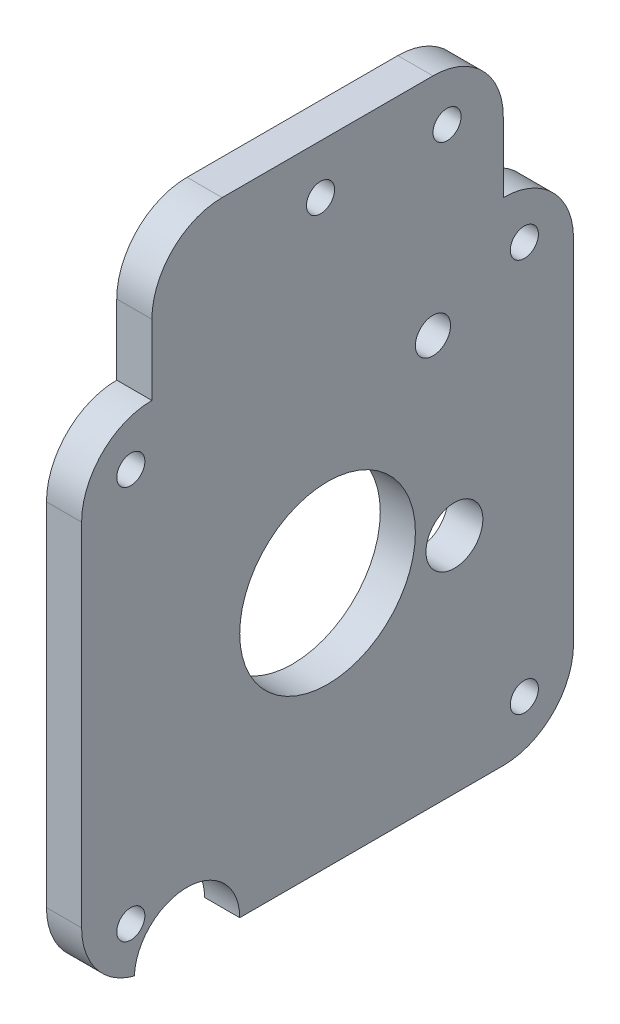
ISO-10303-21;
HEADER;
FILE_DESCRIPTION(('STEP AP214'),'2;1');
FILE_NAME('part.step','',(''),(''),'','','');
FILE_SCHEMA(('AUTOMOTIVE_DESIGN { 1 0 10303 214 1 1 1 1 }'));
ENDSEC;
DATA;
#1=APPLICATION_CONTEXT('core data for automotive mechanical design processes');
#2=APPLICATION_PROTOCOL_DEFINITION('international standard','automotive_design',2000,#1);
#3=PRODUCT_CONTEXT('',#1,'mechanical');
#4=PRODUCT('Part','Part','',(#3));
#5=PRODUCT_RELATED_PRODUCT_CATEGORY('part','',(#4));
#6=PRODUCT_DEFINITION_FORMATION('','',#4);
#7=PRODUCT_DEFINITION_CONTEXT('part definition',#1,'design');
#8=PRODUCT_DEFINITION('design','',#6,#7);
#9=PRODUCT_DEFINITION_SHAPE('','',#8);
#10=(LENGTH_UNIT() NAMED_UNIT(*) SI_UNIT(.MILLI.,.METRE.));
#11=(NAMED_UNIT(*) PLANE_ANGLE_UNIT() SI_UNIT($,.RADIAN.));
#12=(NAMED_UNIT(*) SI_UNIT($,.STERADIAN.) SOLID_ANGLE_UNIT());
#13=UNCERTAINTY_MEASURE_WITH_UNIT(LENGTH_MEASURE(1.E-05),#10,'distance_accuracy_value','');
#14=(GEOMETRIC_REPRESENTATION_CONTEXT(3) GLOBAL_UNCERTAINTY_ASSIGNED_CONTEXT((#13)) GLOBAL_UNIT_ASSIGNED_CONTEXT((#10,
#11,#12)) REPRESENTATION_CONTEXT('',''));
#15=CARTESIAN_POINT('',(0.,0.,0.));
#16=DIRECTION('',(0.,0.,1.));
#17=DIRECTION('',(1.,0.,0.));
#18=AXIS2_PLACEMENT_3D('',#15,#16,#17);
#19=CARTESIAN_POINT('',(5.,10.,-10.));
#20=DIRECTION('',(-1.,0.,0.));
#21=DIRECTION('',(0.,0.,1.));
#22=AXIS2_PLACEMENT_3D('',#19,#20,#21);
#23=PLANE('',#22);
#24=CARTESIAN_POINT('',(5.,58.,-50.));
#25=DIRECTION('',(1.,0.,0.));
#26=DIRECTION('',(0.,0.,-1.));
#27=AXIS2_PLACEMENT_3D('',#24,#25,#26);
#28=CIRCLE('',#27,2.5);
#29=CARTESIAN_POINT('',(5.,58.,-52.5));
#30=VERTEX_POINT('',#29);
#31=EDGE_CURVE('E213',#30,#30,#28,.T.);
#32=ORIENTED_EDGE('',*,*,#31,.F.);
#33=EDGE_LOOP('',(#32));
#34=FACE_BOUND('',#33,.T.);
#35=CARTESIAN_POINT('',(5.,83.,-52.));
#36=DIRECTION('',(1.,0.,0.));
#37=DIRECTION('',(0.,0.,-1.));
#38=AXIS2_PLACEMENT_3D('',#35,#36,#37);
#39=CIRCLE('',#38,2.);
#40=CARTESIAN_POINT('',(5.,83.,-54.));
#41=VERTEX_POINT('',#40);
#42=EDGE_CURVE('E538',#41,#41,#39,.T.);
#43=ORIENTED_EDGE('',*,*,#42,.F.);
#44=EDGE_LOOP('',(#43));
#45=FACE_BOUND('',#44,.T.);
#46=CARTESIAN_POINT('',(5.,83.,-34.));
#47=DIRECTION('',(1.,0.,0.));
#48=DIRECTION('',(0.,0.,-1.));
#49=AXIS2_PLACEMENT_3D('',#46,#47,#48);
#50=CIRCLE('',#49,2.);
#51=CARTESIAN_POINT('',(5.,83.,-36.));
#52=VERTEX_POINT('',#51);
#53=EDGE_CURVE('E228',#52,#52,#50,.T.);
#54=ORIENTED_EDGE('',*,*,#53,.F.);
#55=EDGE_LOOP('',(#54));
#56=FACE_BOUND('',#55,.T.);
#57=CARTESIAN_POINT('',(5.,10.,-10.));
#58=DIRECTION('',(1.,0.,0.));
#59=DIRECTION('',(0.,0.,1.));
#60=AXIS2_PLACEMENT_3D('',#57,#58,#59);
#61=CIRCLE('',#60,10.);
#62=CARTESIAN_POINT('',(5.,10.0000000000001,0.));
#63=VERTEX_POINT('',#62);
#64=CARTESIAN_POINT('',(5.,0.315826351423624,-7.50665270284725));
#65=VERTEX_POINT('',#64);
#66=EDGE_CURVE('E186',#63,#65,#61,.T.);
#67=ORIENTED_EDGE('',*,*,#66,.T.);
#68=CARTESIAN_POINT('',(5.,0.,-15.));
#69=DIRECTION('',(1.,0.,0.));
#70=DIRECTION('',(0.,0.,-1.));
#71=AXIS2_PLACEMENT_3D('',#68,#69,#70);
#72=CIRCLE('',#71,7.5);
#73=CARTESIAN_POINT('',(5.,0.,-22.5));
#74=VERTEX_POINT('',#73);
#75=EDGE_CURVE('E218',#74,#65,#72,.T.);
#76=ORIENTED_EDGE('',*,*,#75,.F.);
#77=DIRECTION('',(0.,0.,-1.));
#78=VECTOR('',#77,1.);
#79=CARTESIAN_POINT('',(5.,0.,-10.0000000000001));
#80=LINE('',#79,#78);
#81=CARTESIAN_POINT('',(5.,0.,-60.));
#82=VERTEX_POINT('',#81);
#83=EDGE_CURVE('E109',#74,#82,#80,.T.);
#84=ORIENTED_EDGE('',*,*,#83,.T.);
#85=CARTESIAN_POINT('',(5.,9.99999999999999,-60.));
#86=DIRECTION('',(1.,0.,0.));
#87=DIRECTION('',(0.,0.,-1.));
#88=AXIS2_PLACEMENT_3D('',#85,#86,#87);
#89=CIRCLE('',#88,10.);
#90=CARTESIAN_POINT('',(5.,9.99999999999999,-70.));
#91=VERTEX_POINT('',#90);
#92=EDGE_CURVE('E269',#82,#91,#89,.T.);
#93=ORIENTED_EDGE('',*,*,#92,.T.);
#94=DIRECTION('',(0.,1.,0.));
#95=VECTOR('',#94,1.);
#96=CARTESIAN_POINT('',(5.,10.,-70.));
#97=LINE('',#96,#95);
#98=CARTESIAN_POINT('',(5.,60.,-70.));
#99=VERTEX_POINT('',#98);
#100=EDGE_CURVE('E271',#91,#99,#97,.T.);
#101=ORIENTED_EDGE('',*,*,#100,.T.);
#102=CARTESIAN_POINT('',(5.,60.,-60.));
#103=DIRECTION('',(1.,0.,0.));
#104=DIRECTION('',(0.,0.,1.));
#105=AXIS2_PLACEMENT_3D('',#102,#103,#104);
#106=CIRCLE('',#105,10.);
#107=CARTESIAN_POINT('',(5.,70.,-60.));
#108=VERTEX_POINT('',#107);
#109=EDGE_CURVE('E273',#99,#108,#106,.T.);
#110=ORIENTED_EDGE('',*,*,#109,.T.);
#111=DIRECTION('',(0.,1.,0.));
#112=VECTOR('',#111,1.);
#113=CARTESIAN_POINT('',(5.,70.,-60.));
#114=LINE('',#113,#112);
#115=CARTESIAN_POINT('',(5.,80.,-60.));
#116=VERTEX_POINT('',#115);
#117=EDGE_CURVE('E275',#108,#116,#114,.T.);
#118=ORIENTED_EDGE('',*,*,#117,.T.);
#119=CARTESIAN_POINT('',(5.,80.,-50.));
#120=DIRECTION('',(1.,0.,0.));
#121=DIRECTION('',(0.,0.,-1.));
#122=AXIS2_PLACEMENT_3D('',#119,#120,#121);
#123=CIRCLE('',#122,9.99999999999999);
#124=CARTESIAN_POINT('',(5.,90.,-50.));
#125=VERTEX_POINT('',#124);
#126=EDGE_CURVE('E277',#116,#125,#123,.T.);
#127=ORIENTED_EDGE('',*,*,#126,.T.);
#128=DIRECTION('',(0.,0.,1.));
#129=VECTOR('',#128,1.);
#130=CARTESIAN_POINT('',(5.,90.,-50.));
#131=LINE('',#130,#129);
#132=CARTESIAN_POINT('',(5.,90.,-20.));
#133=VERTEX_POINT('',#132);
#134=EDGE_CURVE('E279',#125,#133,#131,.T.);
#135=ORIENTED_EDGE('',*,*,#134,.T.);
#136=CARTESIAN_POINT('',(5.,80.,-20.));
#137=DIRECTION('',(1.,0.,0.));
#138=DIRECTION('',(0.,0.,-1.));
#139=AXIS2_PLACEMENT_3D('',#136,#137,#138);
#140=CIRCLE('',#139,9.99999999999999);
#141=CARTESIAN_POINT('',(5.,80.,-10.));
#142=VERTEX_POINT('',#141);
#143=EDGE_CURVE('E141',#133,#142,#140,.T.);
#144=ORIENTED_EDGE('',*,*,#143,.T.);
#145=DIRECTION('',(0.,-1.,0.));
#146=VECTOR('',#145,1.);
#147=CARTESIAN_POINT('',(5.,70.,-10.));
#148=LINE('',#147,#146);
#149=CARTESIAN_POINT('',(5.,70.,-10.));
#150=VERTEX_POINT('',#149);
#151=EDGE_CURVE('E134',#142,#150,#148,.T.);
#152=ORIENTED_EDGE('',*,*,#151,.T.);
#153=CARTESIAN_POINT('',(5.,60.,-10.));
#154=DIRECTION('',(1.,0.,0.));
#155=DIRECTION('',(0.,0.,1.));
#156=AXIS2_PLACEMENT_3D('',#153,#154,#155);
#157=CIRCLE('',#156,10.);
#158=CARTESIAN_POINT('',(5.,60.,0.));
#159=VERTEX_POINT('',#158);
#160=EDGE_CURVE('E138',#150,#159,#157,.T.);
#161=ORIENTED_EDGE('',*,*,#160,.T.);
#162=DIRECTION('',(0.,-1.,0.));
#163=VECTOR('',#162,1.);
#164=CARTESIAN_POINT('',(5.,10.0000000000001,0.));
#165=LINE('',#164,#163);
#166=EDGE_CURVE('E59',#159,#63,#165,.T.);
#167=ORIENTED_EDGE('',*,*,#166,.T.);
#168=EDGE_LOOP('',(#67,#76,#84,#93,#101,#110,#118,#127,#135,#144,#152,#161,#167));
#169=FACE_BOUND('',#168,.T.);
#170=CARTESIAN_POINT('',(5.,63.,-7.));
#171=DIRECTION('',(1.,0.,0.));
#172=DIRECTION('',(0.,0.,-1.));
#173=AXIS2_PLACEMENT_3D('',#170,#171,#172);
#174=CIRCLE('',#173,2.);
#175=CARTESIAN_POINT('',(5.,63.,-9.));
#176=VERTEX_POINT('',#175);
#177=EDGE_CURVE('E166',#176,#176,#174,.T.);
#178=ORIENTED_EDGE('',*,*,#177,.F.);
#179=EDGE_LOOP('',(#178));
#180=FACE_BOUND('',#179,.T.);
#181=CARTESIAN_POINT('',(5.,63.,-63.));
#182=DIRECTION('',(1.,0.,0.));
#183=DIRECTION('',(0.,0.,1.));
#184=AXIS2_PLACEMENT_3D('',#181,#182,#183);
#185=CIRCLE('',#184,2.);
#186=CARTESIAN_POINT('',(5.,63.,-61.));
#187=VERTEX_POINT('',#186);
#188=EDGE_CURVE('E257',#187,#187,#185,.T.);
#189=ORIENTED_EDGE('',*,*,#188,.F.);
#190=EDGE_LOOP('',(#189));
#191=FACE_BOUND('',#190,.T.);
#192=CARTESIAN_POINT('',(5.,6.99999999999999,-63.));
#193=DIRECTION('',(1.,0.,0.));
#194=DIRECTION('',(0.,0.,-1.));
#195=AXIS2_PLACEMENT_3D('',#192,#193,#194);
#196=CIRCLE('',#195,2.);
#197=CARTESIAN_POINT('',(5.,6.99999999999999,-65.));
#198=VERTEX_POINT('',#197);
#199=EDGE_CURVE('E251',#198,#198,#196,.T.);
#200=ORIENTED_EDGE('',*,*,#199,.F.);
#201=EDGE_LOOP('',(#200));
#202=FACE_BOUND('',#201,.T.);
#203=CARTESIAN_POINT('',(5.,7.,-7.));
#204=DIRECTION('',(1.,0.,0.));
#205=DIRECTION('',(0.,0.,1.));
#206=AXIS2_PLACEMENT_3D('',#203,#204,#205);
#207=CIRCLE('',#206,2.);
#208=CARTESIAN_POINT('',(5.,7.,-5.));
#209=VERTEX_POINT('',#208);
#210=EDGE_CURVE('E245',#209,#209,#207,.T.);
#211=ORIENTED_EDGE('',*,*,#210,.F.);
#212=EDGE_LOOP('',(#211));
#213=FACE_BOUND('',#212,.T.);
#214=CARTESIAN_POINT('',(5.,35.,-35.));
#215=DIRECTION('',(1.,0.,0.));
#216=DIRECTION('',(0.,0.,-1.));
#217=AXIS2_PLACEMENT_3D('',#214,#215,#216);
#218=CIRCLE('',#217,12.5);
#219=CARTESIAN_POINT('',(5.,35.,-47.5));
#220=VERTEX_POINT('',#219);
#221=EDGE_CURVE('E239',#220,#220,#218,.T.);
#222=ORIENTED_EDGE('',*,*,#221,.F.);
#223=EDGE_LOOP('',(#222));
#224=FACE_BOUND('',#223,.T.);
#225=CARTESIAN_POINT('',(5.,31.84,-53.05));
#226=DIRECTION('',(1.,0.,0.));
#227=DIRECTION('',(0.,0.,-1.));
#228=AXIS2_PLACEMENT_3D('',#225,#226,#227);
#229=CIRCLE('',#228,4.05);
#230=CARTESIAN_POINT('',(5.,31.84,-57.1));
#231=VERTEX_POINT('',#230);
#232=EDGE_CURVE('E233',#231,#231,#229,.T.);
#233=ORIENTED_EDGE('',*,*,#232,.F.);
#234=EDGE_LOOP('',(#233));
#235=FACE_BOUND('',#234,.T.);
#236=ADVANCED_FACE('F34',(#34,#45,#56,#169,#180,#191,#202,#213,#224,#235),#23,.F.);
#237=CARTESIAN_POINT('',(0.,10.,-10.));
#238=DIRECTION('',(-1.,0.,0.));
#239=DIRECTION('',(0.,0.,1.));
#240=AXIS2_PLACEMENT_3D('',#237,#238,#239);
#241=PLANE('',#240);
#242=CARTESIAN_POINT('',(0.,58.,-50.));
#243=DIRECTION('',(-1.,0.,0.));
#244=DIRECTION('',(0.,0.,1.));
#245=AXIS2_PLACEMENT_3D('',#242,#243,#244);
#246=CIRCLE('',#245,2.5);
#247=CARTESIAN_POINT('',(0.,58.,-47.5));
#248=VERTEX_POINT('',#247);
#249=EDGE_CURVE('E38',#248,#248,#246,.T.);
#250=ORIENTED_EDGE('',*,*,#249,.F.);
#251=EDGE_LOOP('',(#250));
#252=FACE_BOUND('',#251,.T.);
#253=CARTESIAN_POINT('',(0.,83.,-52.));
#254=DIRECTION('',(-1.,0.,0.));
#255=DIRECTION('',(0.,0.,1.));
#256=AXIS2_PLACEMENT_3D('',#253,#254,#255);
#257=CIRCLE('',#256,2.);
#258=CARTESIAN_POINT('',(0.,83.,-50.));
#259=VERTEX_POINT('',#258);
#260=EDGE_CURVE('E212',#259,#259,#257,.T.);
#261=ORIENTED_EDGE('',*,*,#260,.F.);
#262=EDGE_LOOP('',(#261));
#263=FACE_BOUND('',#262,.T.);
#264=CARTESIAN_POINT('',(0.,83.,-34.));
#265=DIRECTION('',(-1.,0.,0.));
#266=DIRECTION('',(0.,0.,1.));
#267=AXIS2_PLACEMENT_3D('',#264,#265,#266);
#268=CIRCLE('',#267,2.);
#269=CARTESIAN_POINT('',(0.,83.,-32.));
#270=VERTEX_POINT('',#269);
#271=EDGE_CURVE('E210',#270,#270,#268,.T.);
#272=ORIENTED_EDGE('',*,*,#271,.F.);
#273=EDGE_LOOP('',(#272));
#274=FACE_BOUND('',#273,.T.);
#275=CARTESIAN_POINT('',(0.,0.,-15.));
#276=DIRECTION('',(-1.,0.,0.));
#277=DIRECTION('',(0.,0.,1.));
#278=AXIS2_PLACEMENT_3D('',#275,#276,#277);
#279=CIRCLE('',#278,7.5);
#280=CARTESIAN_POINT('',(0.,0.315826351423625,-7.50665270284725));
#281=VERTEX_POINT('',#280);
#282=CARTESIAN_POINT('',(0.,0.,-22.5));
#283=VERTEX_POINT('',#282);
#284=EDGE_CURVE('E51',#281,#283,#279,.T.);
#285=ORIENTED_EDGE('',*,*,#284,.F.);
#286=CARTESIAN_POINT('',(0.,10.,-10.));
#287=DIRECTION('',(1.,0.,0.));
#288=DIRECTION('',(0.,0.,1.));
#289=AXIS2_PLACEMENT_3D('',#286,#287,#288);
#290=CIRCLE('',#289,10.);
#291=CARTESIAN_POINT('',(0.,10.0000000000001,0.));
#292=VERTEX_POINT('',#291);
#293=EDGE_CURVE('E162',#292,#281,#290,.T.);
#294=ORIENTED_EDGE('',*,*,#293,.F.);
#295=DIRECTION('',(0.,-1.,0.));
#296=VECTOR('',#295,1.);
#297=CARTESIAN_POINT('',(0.,10.0000000000001,0.));
#298=LINE('',#297,#296);
#299=CARTESIAN_POINT('',(0.,60.,0.));
#300=VERTEX_POINT('',#299);
#301=EDGE_CURVE('E101',#300,#292,#298,.T.);
#302=ORIENTED_EDGE('',*,*,#301,.F.);
#303=CARTESIAN_POINT('',(0.,60.,-10.));
#304=DIRECTION('',(1.,0.,0.));
#305=DIRECTION('',(0.,0.,1.));
#306=AXIS2_PLACEMENT_3D('',#303,#304,#305);
#307=CIRCLE('',#306,10.);
#308=CARTESIAN_POINT('',(0.,70.,-10.));
#309=VERTEX_POINT('',#308);
#310=EDGE_CURVE('E183',#309,#300,#307,.T.);
#311=ORIENTED_EDGE('',*,*,#310,.F.);
#312=DIRECTION('',(0.,-1.,0.));
#313=VECTOR('',#312,1.);
#314=CARTESIAN_POINT('',(0.,70.,-10.));
#315=LINE('',#314,#313);
#316=CARTESIAN_POINT('',(0.,80.,-10.));
#317=VERTEX_POINT('',#316);
#318=EDGE_CURVE('E150',#317,#309,#315,.T.);
#319=ORIENTED_EDGE('',*,*,#318,.F.);
#320=CARTESIAN_POINT('',(0.,80.,-20.));
#321=DIRECTION('',(1.,0.,0.));
#322=DIRECTION('',(0.,0.,-1.));
#323=AXIS2_PLACEMENT_3D('',#320,#321,#322);
#324=CIRCLE('',#323,9.99999999999999);
#325=CARTESIAN_POINT('',(0.,90.,-20.));
#326=VERTEX_POINT('',#325);
#327=EDGE_CURVE('E180',#326,#317,#324,.T.);
#328=ORIENTED_EDGE('',*,*,#327,.F.);
#329=DIRECTION('',(0.,0.,1.));
#330=VECTOR('',#329,1.);
#331=CARTESIAN_POINT('',(0.,90.,-50.));
#332=LINE('',#331,#330);
#333=CARTESIAN_POINT('',(0.,90.,-50.));
#334=VERTEX_POINT('',#333);
#335=EDGE_CURVE('E178',#334,#326,#332,.T.);
#336=ORIENTED_EDGE('',*,*,#335,.F.);
#337=CARTESIAN_POINT('',(0.,80.,-50.));
#338=DIRECTION('',(1.,0.,0.));
#339=DIRECTION('',(0.,0.,-1.));
#340=AXIS2_PLACEMENT_3D('',#337,#338,#339);
#341=CIRCLE('',#340,9.99999999999999);
#342=CARTESIAN_POINT('',(0.,80.,-60.));
#343=VERTEX_POINT('',#342);
#344=EDGE_CURVE('E176',#343,#334,#341,.T.);
#345=ORIENTED_EDGE('',*,*,#344,.F.);
#346=DIRECTION('',(0.,1.,0.));
#347=VECTOR('',#346,1.);
#348=CARTESIAN_POINT('',(0.,70.,-60.));
#349=LINE('',#348,#347);
#350=CARTESIAN_POINT('',(0.,70.,-60.));
#351=VERTEX_POINT('',#350);
#352=EDGE_CURVE('E174',#351,#343,#349,.T.);
#353=ORIENTED_EDGE('',*,*,#352,.F.);
#354=CARTESIAN_POINT('',(0.,60.,-60.));
#355=DIRECTION('',(1.,0.,0.));
#356=DIRECTION('',(0.,0.,1.));
#357=AXIS2_PLACEMENT_3D('',#354,#355,#356);
#358=CIRCLE('',#357,10.);
#359=CARTESIAN_POINT('',(0.,60.,-70.));
#360=VERTEX_POINT('',#359);
#361=EDGE_CURVE('E172',#360,#351,#358,.T.);
#362=ORIENTED_EDGE('',*,*,#361,.F.);
#363=DIRECTION('',(0.,1.,0.));
#364=VECTOR('',#363,1.);
#365=CARTESIAN_POINT('',(0.,10.,-70.));
#366=LINE('',#365,#364);
#367=CARTESIAN_POINT('',(0.,9.99999999999999,-70.));
#368=VERTEX_POINT('',#367);
#369=EDGE_CURVE('E170',#368,#360,#366,.T.);
#370=ORIENTED_EDGE('',*,*,#369,.F.);
#371=CARTESIAN_POINT('',(0.,9.99999999999999,-60.));
#372=DIRECTION('',(1.,0.,0.));
#373=DIRECTION('',(0.,0.,-1.));
#374=AXIS2_PLACEMENT_3D('',#371,#372,#373);
#375=CIRCLE('',#374,10.);
#376=CARTESIAN_POINT('',(0.,0.,-60.));
#377=VERTEX_POINT('',#376);
#378=EDGE_CURVE('E168',#377,#368,#375,.T.);
#379=ORIENTED_EDGE('',*,*,#378,.F.);
#380=DIRECTION('',(0.,0.,-1.));
#381=VECTOR('',#380,1.);
#382=CARTESIAN_POINT('',(0.,0.,-10.0000000000001));
#383=LINE('',#382,#381);
#384=EDGE_CURVE('E165',#283,#377,#383,.T.);
#385=ORIENTED_EDGE('',*,*,#384,.F.);
#386=EDGE_LOOP('',(#285,#294,#302,#311,#319,#328,#336,#345,#353,#362,#370,#379,#385));
#387=FACE_BOUND('',#386,.T.);
#388=CARTESIAN_POINT('',(0.,35.,-35.));
#389=DIRECTION('',(1.,0.,0.));
#390=DIRECTION('',(0.,0.,-1.));
#391=AXIS2_PLACEMENT_3D('',#388,#389,#390);
#392=CIRCLE('',#391,12.5);
#393=CARTESIAN_POINT('',(0.,35.,-47.5));
#394=VERTEX_POINT('',#393);
#395=EDGE_CURVE('E236',#394,#394,#392,.T.);
#396=ORIENTED_EDGE('',*,*,#395,.T.);
#397=EDGE_LOOP('',(#396));
#398=FACE_BOUND('',#397,.T.);
#399=CARTESIAN_POINT('',(0.,6.99999999999999,-63.));
#400=DIRECTION('',(1.,0.,0.));
#401=DIRECTION('',(0.,0.,-1.));
#402=AXIS2_PLACEMENT_3D('',#399,#400,#401);
#403=CIRCLE('',#402,2.);
#404=CARTESIAN_POINT('',(0.,6.99999999999999,-65.));
#405=VERTEX_POINT('',#404);
#406=EDGE_CURVE('E248',#405,#405,#403,.T.);
#407=ORIENTED_EDGE('',*,*,#406,.T.);
#408=EDGE_LOOP('',(#407));
#409=FACE_BOUND('',#408,.T.);
#410=CARTESIAN_POINT('',(0.,63.,-7.));
#411=DIRECTION('',(1.,0.,0.));
#412=DIRECTION('',(0.,0.,-1.));
#413=AXIS2_PLACEMENT_3D('',#410,#411,#412);
#414=CIRCLE('',#413,2.);
#415=CARTESIAN_POINT('',(0.,63.,-9.));
#416=VERTEX_POINT('',#415);
#417=EDGE_CURVE('E260',#416,#416,#414,.T.);
#418=ORIENTED_EDGE('',*,*,#417,.T.);
#419=EDGE_LOOP('',(#418));
#420=FACE_BOUND('',#419,.T.);
#421=CARTESIAN_POINT('',(0.,63.,-63.));
#422=DIRECTION('',(1.,0.,0.));
#423=DIRECTION('',(0.,0.,1.));
#424=AXIS2_PLACEMENT_3D('',#421,#422,#423);
#425=CIRCLE('',#424,2.);
#426=CARTESIAN_POINT('',(0.,63.,-61.));
#427=VERTEX_POINT('',#426);
#428=EDGE_CURVE('E254',#427,#427,#425,.T.);
#429=ORIENTED_EDGE('',*,*,#428,.T.);
#430=EDGE_LOOP('',(#429));
#431=FACE_BOUND('',#430,.T.);
#432=CARTESIAN_POINT('',(0.,7.,-7.));
#433=DIRECTION('',(1.,0.,0.));
#434=DIRECTION('',(0.,0.,1.));
#435=AXIS2_PLACEMENT_3D('',#432,#433,#434);
#436=CIRCLE('',#435,2.);
#437=CARTESIAN_POINT('',(0.,7.,-5.));
#438=VERTEX_POINT('',#437);
#439=EDGE_CURVE('E242',#438,#438,#436,.T.);
#440=ORIENTED_EDGE('',*,*,#439,.T.);
#441=EDGE_LOOP('',(#440));
#442=FACE_BOUND('',#441,.T.);
#443=CARTESIAN_POINT('',(0.,31.84,-53.05));
#444=DIRECTION('',(1.,0.,0.));
#445=DIRECTION('',(0.,0.,-1.));
#446=AXIS2_PLACEMENT_3D('',#443,#444,#445);
#447=CIRCLE('',#446,4.05);
#448=CARTESIAN_POINT('',(0.,31.84,-57.1));
#449=VERTEX_POINT('',#448);
#450=EDGE_CURVE('E232',#449,#449,#447,.T.);
#451=ORIENTED_EDGE('',*,*,#450,.T.);
#452=EDGE_LOOP('',(#451));
#453=FACE_BOUND('',#452,.T.);
#454=ADVANCED_FACE('F291',(#252,#263,#274,#387,#398,#409,#420,#431,#442,#453),#241,.T.);
#455=CARTESIAN_POINT('',(5.,10.,-10.));
#456=DIRECTION('',(-1.,0.,0.));
#457=DIRECTION('',(0.,0.,1.));
#458=AXIS2_PLACEMENT_3D('',#455,#456,#457);
#459=CYLINDRICAL_SURFACE('',#458,10.);
#460=ORIENTED_EDGE('',*,*,#293,.T.);
#461=DIRECTION('',(1.,0.,0.));
#462=VECTOR('',#461,1.);
#463=CARTESIAN_POINT('',(0.,0.315826351423624,-7.50665270284725));
#464=LINE('',#463,#462);
#465=EDGE_CURVE('E225',#281,#65,#464,.T.);
#466=ORIENTED_EDGE('',*,*,#465,.T.);
#467=ORIENTED_EDGE('',*,*,#66,.F.);
#468=DIRECTION('',(-1.,0.,0.));
#469=VECTOR('',#468,1.);
#470=CARTESIAN_POINT('',(5.,10.0000000000001,0.));
#471=LINE('',#470,#469);
#472=EDGE_CURVE('E158',#63,#292,#471,.T.);
#473=ORIENTED_EDGE('',*,*,#472,.T.);
#474=EDGE_LOOP('',(#460,#466,#467,#473));
#475=FACE_BOUND('',#474,.T.);
#476=ADVANCED_FACE('F36',(#475),#459,.T.);
#477=CARTESIAN_POINT('',(5.,0.,-10.0000000000001));
#478=DIRECTION('',(0.,1.,0.));
#479=DIRECTION('',(0.,0.,1.));
#480=AXIS2_PLACEMENT_3D('',#477,#478,#479);
#481=PLANE('',#480);
#482=ORIENTED_EDGE('',*,*,#83,.F.);
#483=DIRECTION('',(1.,0.,0.));
#484=VECTOR('',#483,1.);
#485=CARTESIAN_POINT('',(-5.,0.,-22.5));
#486=LINE('',#485,#484);
#487=EDGE_CURVE('E11',#74,#283,#486,.F.);
#488=ORIENTED_EDGE('',*,*,#487,.T.);
#489=ORIENTED_EDGE('',*,*,#384,.T.);
#490=DIRECTION('',(-1.,0.,0.));
#491=VECTOR('',#490,1.);
#492=CARTESIAN_POINT('',(5.,0.,-60.));
#493=LINE('',#492,#491);
#494=EDGE_CURVE('E43',#82,#377,#493,.T.);
#495=ORIENTED_EDGE('',*,*,#494,.F.);
#496=EDGE_LOOP('',(#482,#488,#489,#495));
#497=FACE_BOUND('',#496,.T.);
#498=ADVANCED_FACE('F302',(#497),#481,.F.);
#499=CARTESIAN_POINT('',(5.,9.99999999999999,-60.));
#500=DIRECTION('',(-1.,0.,0.));
#501=DIRECTION('',(0.,0.,1.));
#502=AXIS2_PLACEMENT_3D('',#499,#500,#501);
#503=CYLINDRICAL_SURFACE('',#502,10.);
#504=ORIENTED_EDGE('',*,*,#378,.T.);
#505=DIRECTION('',(-1.,0.,0.));
#506=VECTOR('',#505,1.);
#507=CARTESIAN_POINT('',(5.,9.99999999999999,-70.));
#508=LINE('',#507,#506);
#509=EDGE_CURVE('E205',#91,#368,#508,.T.);
#510=ORIENTED_EDGE('',*,*,#509,.F.);
#511=ORIENTED_EDGE('',*,*,#92,.F.);
#512=ORIENTED_EDGE('',*,*,#494,.T.);
#513=EDGE_LOOP('',(#504,#510,#511,#512));
#514=FACE_BOUND('',#513,.T.);
#515=ADVANCED_FACE('F308',(#514),#503,.T.);
#516=CARTESIAN_POINT('',(5.,10.,-70.));
#517=DIRECTION('',(0.,0.,1.));
#518=DIRECTION('',(0.,-1.,0.));
#519=AXIS2_PLACEMENT_3D('',#516,#517,#518);
#520=PLANE('',#519);
#521=ORIENTED_EDGE('',*,*,#369,.T.);
#522=DIRECTION('',(-1.,0.,0.));
#523=VECTOR('',#522,1.);
#524=CARTESIAN_POINT('',(5.,60.,-70.));
#525=LINE('',#524,#523);
#526=EDGE_CURVE('E202',#99,#360,#525,.T.);
#527=ORIENTED_EDGE('',*,*,#526,.F.);
#528=ORIENTED_EDGE('',*,*,#100,.F.);
#529=ORIENTED_EDGE('',*,*,#509,.T.);
#530=EDGE_LOOP('',(#521,#527,#528,#529));
#531=FACE_BOUND('',#530,.T.);
#532=ADVANCED_FACE('F312',(#531),#520,.F.);
#533=CARTESIAN_POINT('',(5.,60.,-60.));
#534=DIRECTION('',(-1.,0.,0.));
#535=DIRECTION('',(0.,0.,1.));
#536=AXIS2_PLACEMENT_3D('',#533,#534,#535);
#537=CYLINDRICAL_SURFACE('',#536,10.);
#538=ORIENTED_EDGE('',*,*,#361,.T.);
#539=DIRECTION('',(-1.,0.,0.));
#540=VECTOR('',#539,1.);
#541=CARTESIAN_POINT('',(5.,70.,-60.));
#542=LINE('',#541,#540);
#543=EDGE_CURVE('E199',#108,#351,#542,.T.);
#544=ORIENTED_EDGE('',*,*,#543,.F.);
#545=ORIENTED_EDGE('',*,*,#109,.F.);
#546=ORIENTED_EDGE('',*,*,#526,.T.);
#547=EDGE_LOOP('',(#538,#544,#545,#546));
#548=FACE_BOUND('',#547,.T.);
#549=ADVANCED_FACE('F319',(#548),#537,.T.);
#550=CARTESIAN_POINT('',(5.,70.,-60.));
#551=DIRECTION('',(0.,0.,1.));
#552=DIRECTION('',(0.,-1.,0.));
#553=AXIS2_PLACEMENT_3D('',#550,#551,#552);
#554=PLANE('',#553);
#555=ORIENTED_EDGE('',*,*,#352,.T.);
#556=DIRECTION('',(-1.,0.,0.));
#557=VECTOR('',#556,1.);
#558=CARTESIAN_POINT('',(5.,80.,-60.));
#559=LINE('',#558,#557);
#560=EDGE_CURVE('E196',#116,#343,#559,.T.);
#561=ORIENTED_EDGE('',*,*,#560,.F.);
#562=ORIENTED_EDGE('',*,*,#117,.F.);
#563=ORIENTED_EDGE('',*,*,#543,.T.);
#564=EDGE_LOOP('',(#555,#561,#562,#563));
#565=FACE_BOUND('',#564,.T.);
#566=ADVANCED_FACE('F322',(#565),#554,.F.);
#567=CARTESIAN_POINT('',(5.,80.,-50.));
#568=DIRECTION('',(-1.,0.,0.));
#569=DIRECTION('',(0.,0.,1.));
#570=AXIS2_PLACEMENT_3D('',#567,#568,#569);
#571=CYLINDRICAL_SURFACE('',#570,9.99999999999999);
#572=ORIENTED_EDGE('',*,*,#344,.T.);
#573=DIRECTION('',(-1.,0.,0.));
#574=VECTOR('',#573,1.);
#575=CARTESIAN_POINT('',(5.,90.,-50.));
#576=LINE('',#575,#574);
#577=EDGE_CURVE('E193',#125,#334,#576,.T.);
#578=ORIENTED_EDGE('',*,*,#577,.F.);
#579=ORIENTED_EDGE('',*,*,#126,.F.);
#580=ORIENTED_EDGE('',*,*,#560,.T.);
#581=EDGE_LOOP('',(#572,#578,#579,#580));
#582=FACE_BOUND('',#581,.T.);
#583=ADVANCED_FACE('F325',(#582),#571,.T.);
#584=CARTESIAN_POINT('',(5.,90.,-50.));
#585=DIRECTION('',(0.,-1.,0.));
#586=DIRECTION('',(0.,0.,-1.));
#587=AXIS2_PLACEMENT_3D('',#584,#585,#586);
#588=PLANE('',#587);
#589=ORIENTED_EDGE('',*,*,#335,.T.);
#590=DIRECTION('',(-1.,0.,0.));
#591=VECTOR('',#590,1.);
#592=CARTESIAN_POINT('',(5.,90.,-20.));
#593=LINE('',#592,#591);
#594=EDGE_CURVE('E190',#133,#326,#593,.T.);
#595=ORIENTED_EDGE('',*,*,#594,.F.);
#596=ORIENTED_EDGE('',*,*,#134,.F.);
#597=ORIENTED_EDGE('',*,*,#577,.T.);
#598=EDGE_LOOP('',(#589,#595,#596,#597));
#599=FACE_BOUND('',#598,.T.);
#600=ADVANCED_FACE('F285',(#599),#588,.F.);
#601=CARTESIAN_POINT('',(5.,80.,-20.));
#602=DIRECTION('',(-1.,0.,0.));
#603=DIRECTION('',(0.,0.,1.));
#604=AXIS2_PLACEMENT_3D('',#601,#602,#603);
#605=CYLINDRICAL_SURFACE('',#604,9.99999999999999);
#606=ORIENTED_EDGE('',*,*,#327,.T.);
#607=DIRECTION('',(-1.,0.,0.));
#608=VECTOR('',#607,1.);
#609=CARTESIAN_POINT('',(5.,80.,-10.));
#610=LINE('',#609,#608);
#611=EDGE_CURVE('E153',#142,#317,#610,.T.);
#612=ORIENTED_EDGE('',*,*,#611,.F.);
#613=ORIENTED_EDGE('',*,*,#143,.F.);
#614=ORIENTED_EDGE('',*,*,#594,.T.);
#615=EDGE_LOOP('',(#606,#612,#613,#614));
#616=FACE_BOUND('',#615,.T.);
#617=ADVANCED_FACE('F289',(#616),#605,.T.);
#618=CARTESIAN_POINT('',(5.,70.,-10.));
#619=DIRECTION('',(0.,0.,-1.));
#620=DIRECTION('',(-1.,0.,0.));
#621=AXIS2_PLACEMENT_3D('',#618,#619,#620);
#622=PLANE('',#621);
#623=ORIENTED_EDGE('',*,*,#318,.T.);
#624=DIRECTION('',(-1.,0.,0.));
#625=VECTOR('',#624,1.);
#626=CARTESIAN_POINT('',(5.,70.,-10.));
#627=LINE('',#626,#625);
#628=EDGE_CURVE('E147',#150,#309,#627,.T.);
#629=ORIENTED_EDGE('',*,*,#628,.F.);
#630=ORIENTED_EDGE('',*,*,#151,.F.);
#631=ORIENTED_EDGE('',*,*,#611,.T.);
#632=EDGE_LOOP('',(#623,#629,#630,#631));
#633=FACE_BOUND('',#632,.T.);
#634=ADVANCED_FACE('F148',(#633),#622,.F.);
#635=CARTESIAN_POINT('',(5.,60.,-10.));
#636=DIRECTION('',(-1.,0.,0.));
#637=DIRECTION('',(0.,0.,1.));
#638=AXIS2_PLACEMENT_3D('',#635,#636,#637);
#639=CYLINDRICAL_SURFACE('',#638,10.);
#640=ORIENTED_EDGE('',*,*,#310,.T.);
#641=DIRECTION('',(-1.,0.,0.));
#642=VECTOR('',#641,1.);
#643=CARTESIAN_POINT('',(5.,60.,0.));
#644=LINE('',#643,#642);
#645=EDGE_CURVE('E154',#159,#300,#644,.T.);
#646=ORIENTED_EDGE('',*,*,#645,.F.);
#647=ORIENTED_EDGE('',*,*,#160,.F.);
#648=ORIENTED_EDGE('',*,*,#628,.T.);
#649=EDGE_LOOP('',(#640,#646,#647,#648));
#650=FACE_BOUND('',#649,.T.);
#651=ADVANCED_FACE('F156',(#650),#639,.T.);
#652=CARTESIAN_POINT('',(5.,10.0000000000001,0.));
#653=DIRECTION('',(0.,0.,-1.));
#654=DIRECTION('',(-1.,0.,0.));
#655=AXIS2_PLACEMENT_3D('',#652,#653,#654);
#656=PLANE('',#655);
#657=ORIENTED_EDGE('',*,*,#301,.T.);
#658=ORIENTED_EDGE('',*,*,#472,.F.);
#659=ORIENTED_EDGE('',*,*,#166,.F.);
#660=ORIENTED_EDGE('',*,*,#645,.T.);
#661=EDGE_LOOP('',(#657,#658,#659,#660));
#662=FACE_BOUND('',#661,.T.);
#663=ADVANCED_FACE('F294',(#662),#656,.F.);
#664=CARTESIAN_POINT('',(5.,63.,-7.));
#665=DIRECTION('',(-1.,0.,0.));
#666=DIRECTION('',(0.,0.,1.));
#667=AXIS2_PLACEMENT_3D('',#664,#665,#666);
#668=CYLINDRICAL_SURFACE('',#667,2.);
#669=ORIENTED_EDGE('',*,*,#177,.T.);
#670=EDGE_LOOP('',(#669));
#671=FACE_BOUND('',#670,.T.);
#672=ORIENTED_EDGE('',*,*,#417,.F.);
#673=EDGE_LOOP('',(#672));
#674=FACE_BOUND('',#673,.T.);
#675=ADVANCED_FACE('F345',(#671,#674),#668,.F.);
#676=CARTESIAN_POINT('',(5.,63.,-63.));
#677=DIRECTION('',(-1.,0.,0.));
#678=DIRECTION('',(0.,0.,1.));
#679=AXIS2_PLACEMENT_3D('',#676,#677,#678);
#680=CYLINDRICAL_SURFACE('',#679,2.);
#681=ORIENTED_EDGE('',*,*,#188,.T.);
#682=EDGE_LOOP('',(#681));
#683=FACE_BOUND('',#682,.T.);
#684=ORIENTED_EDGE('',*,*,#428,.F.);
#685=EDGE_LOOP('',(#684));
#686=FACE_BOUND('',#685,.T.);
#687=ADVANCED_FACE('F377',(#683,#686),#680,.F.);
#688=CARTESIAN_POINT('',(5.,6.99999999999999,-63.));
#689=DIRECTION('',(-1.,0.,0.));
#690=DIRECTION('',(0.,0.,1.));
#691=AXIS2_PLACEMENT_3D('',#688,#689,#690);
#692=CYLINDRICAL_SURFACE('',#691,2.);
#693=ORIENTED_EDGE('',*,*,#199,.T.);
#694=EDGE_LOOP('',(#693));
#695=FACE_BOUND('',#694,.T.);
#696=ORIENTED_EDGE('',*,*,#406,.F.);
#697=EDGE_LOOP('',(#696));
#698=FACE_BOUND('',#697,.T.);
#699=ADVANCED_FACE('F384',(#695,#698),#692,.F.);
#700=CARTESIAN_POINT('',(5.,7.,-7.));
#701=DIRECTION('',(-1.,0.,0.));
#702=DIRECTION('',(0.,0.,1.));
#703=AXIS2_PLACEMENT_3D('',#700,#701,#702);
#704=CYLINDRICAL_SURFACE('',#703,2.);
#705=ORIENTED_EDGE('',*,*,#210,.T.);
#706=EDGE_LOOP('',(#705));
#707=FACE_BOUND('',#706,.T.);
#708=ORIENTED_EDGE('',*,*,#439,.F.);
#709=EDGE_LOOP('',(#708));
#710=FACE_BOUND('',#709,.T.);
#711=ADVANCED_FACE('F391',(#707,#710),#704,.F.);
#712=CARTESIAN_POINT('',(5.,35.,-35.));
#713=DIRECTION('',(-1.,0.,0.));
#714=DIRECTION('',(0.,0.,1.));
#715=AXIS2_PLACEMENT_3D('',#712,#713,#714);
#716=CYLINDRICAL_SURFACE('',#715,12.5);
#717=ORIENTED_EDGE('',*,*,#221,.T.);
#718=EDGE_LOOP('',(#717));
#719=FACE_BOUND('',#718,.T.);
#720=ORIENTED_EDGE('',*,*,#395,.F.);
#721=EDGE_LOOP('',(#720));
#722=FACE_BOUND('',#721,.T.);
#723=ADVANCED_FACE('F399',(#719,#722),#716,.F.);
#724=CARTESIAN_POINT('',(5.,31.84,-53.05));
#725=DIRECTION('',(-1.,0.,0.));
#726=DIRECTION('',(0.,0.,1.));
#727=AXIS2_PLACEMENT_3D('',#724,#725,#726);
#728=CYLINDRICAL_SURFACE('',#727,4.05);
#729=ORIENTED_EDGE('',*,*,#232,.T.);
#730=EDGE_LOOP('',(#729));
#731=FACE_BOUND('',#730,.T.);
#732=ORIENTED_EDGE('',*,*,#450,.F.);
#733=EDGE_LOOP('',(#732));
#734=FACE_BOUND('',#733,.T.);
#735=ADVANCED_FACE('F407',(#731,#734),#728,.F.);
#736=CARTESIAN_POINT('',(-5.,0.,-15.));
#737=DIRECTION('',(1.,0.,0.));
#738=DIRECTION('',(0.,0.,-1.));
#739=AXIS2_PLACEMENT_3D('',#736,#737,#738);
#740=CYLINDRICAL_SURFACE('',#739,7.5);
#741=ORIENTED_EDGE('',*,*,#284,.T.);
#742=ORIENTED_EDGE('',*,*,#487,.F.);
#743=ORIENTED_EDGE('',*,*,#75,.T.);
#744=ORIENTED_EDGE('',*,*,#465,.F.);
#745=EDGE_LOOP('',(#741,#742,#743,#744));
#746=FACE_BOUND('',#745,.T.);
#747=ADVANCED_FACE('F299',(#746),#740,.F.);
#748=CARTESIAN_POINT('',(-5.,83.,-34.));
#749=DIRECTION('',(1.,0.,0.));
#750=DIRECTION('',(0.,0.,-1.));
#751=AXIS2_PLACEMENT_3D('',#748,#749,#750);
#752=CYLINDRICAL_SURFACE('',#751,2.);
#753=ORIENTED_EDGE('',*,*,#271,.T.);
#754=EDGE_LOOP('',(#753));
#755=FACE_BOUND('',#754,.T.);
#756=ORIENTED_EDGE('',*,*,#53,.T.);
#757=EDGE_LOOP('',(#756));
#758=FACE_BOUND('',#757,.T.);
#759=ADVANCED_FACE('F422',(#755,#758),#752,.F.);
#760=CARTESIAN_POINT('',(-5.,83.,-52.));
#761=DIRECTION('',(1.,0.,0.));
#762=DIRECTION('',(0.,0.,-1.));
#763=AXIS2_PLACEMENT_3D('',#760,#761,#762);
#764=CYLINDRICAL_SURFACE('',#763,2.);
#765=ORIENTED_EDGE('',*,*,#260,.T.);
#766=EDGE_LOOP('',(#765));
#767=FACE_BOUND('',#766,.T.);
#768=ORIENTED_EDGE('',*,*,#42,.T.);
#769=EDGE_LOOP('',(#768));
#770=FACE_BOUND('',#769,.T.);
#771=ADVANCED_FACE('F430',(#767,#770),#764,.F.);
#772=CARTESIAN_POINT('',(-5.,58.,-50.));
#773=DIRECTION('',(1.,0.,0.));
#774=DIRECTION('',(0.,0.,-1.));
#775=AXIS2_PLACEMENT_3D('',#772,#773,#774);
#776=CYLINDRICAL_SURFACE('',#775,2.5);
#777=ORIENTED_EDGE('',*,*,#249,.T.);
#778=EDGE_LOOP('',(#777));
#779=FACE_BOUND('',#778,.T.);
#780=ORIENTED_EDGE('',*,*,#31,.T.);
#781=EDGE_LOOP('',(#780));
#782=FACE_BOUND('',#781,.T.);
#783=ADVANCED_FACE('F438',(#779,#782),#776,.F.);
#784=CLOSED_SHELL('',(#236,#454,#476,#498,#515,#532,#549,#566,#583,#600,#617,#634,#651,#663,
#675,#687,#699,#711,#723,#735,#747,#759,#771,#783));
#785=MANIFOLD_SOLID_BREP('B2',#784);
#786=ADVANCED_BREP_SHAPE_REPRESENTATION('',(#18,#785),#14);
#787=SHAPE_DEFINITION_REPRESENTATION(#9,#786);
ENDSEC;
END-ISO-10303-21;
